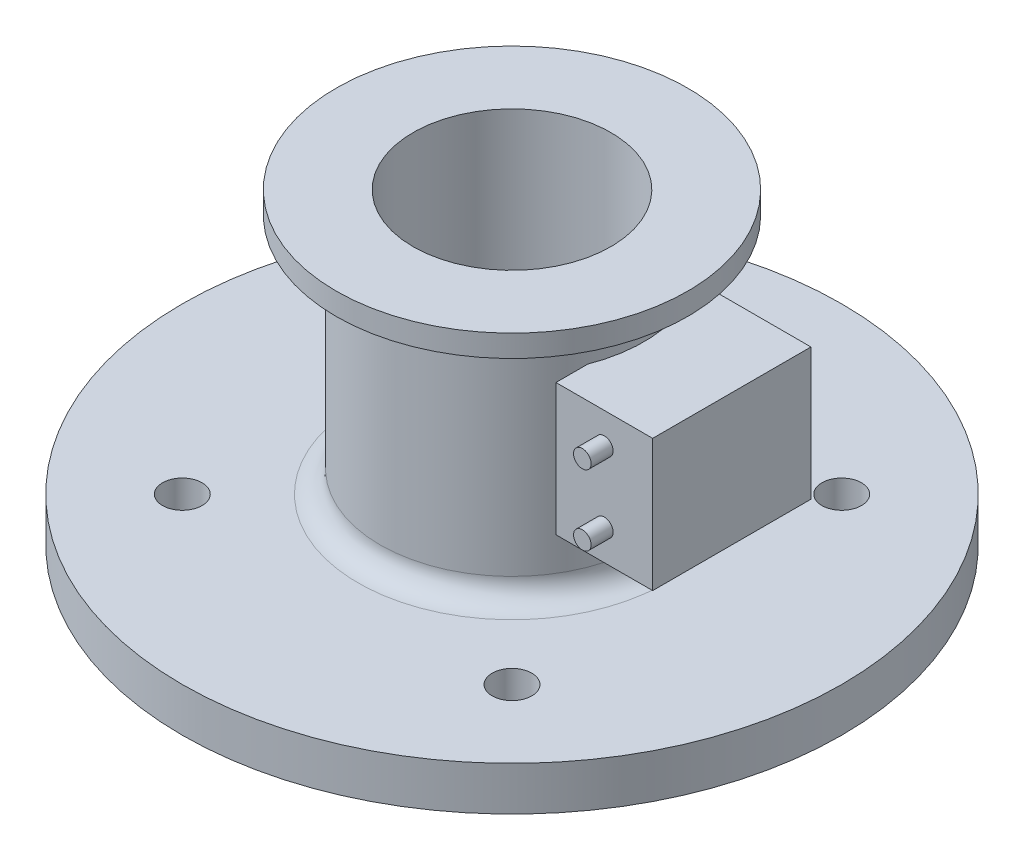
ISO-10303-21;
HEADER;
FILE_DESCRIPTION(('STEP AP214'),'2;1');
FILE_NAME('part.step','',(''),(''),'','','');
FILE_SCHEMA(('AUTOMOTIVE_DESIGN { 1 0 10303 214 1 1 1 1 }'));
ENDSEC;
DATA;
#1=APPLICATION_CONTEXT('core data for automotive mechanical design processes');
#2=APPLICATION_PROTOCOL_DEFINITION('international standard','automotive_design',2000,#1);
#3=PRODUCT_CONTEXT('',#1,'mechanical');
#4=PRODUCT('Part','Part','',(#3));
#5=PRODUCT_RELATED_PRODUCT_CATEGORY('part','',(#4));
#6=PRODUCT_DEFINITION_FORMATION('','',#4);
#7=PRODUCT_DEFINITION_CONTEXT('part definition',#1,'design');
#8=PRODUCT_DEFINITION('design','',#6,#7);
#9=PRODUCT_DEFINITION_SHAPE('','',#8);
#10=(LENGTH_UNIT() NAMED_UNIT(*) SI_UNIT(.MILLI.,.METRE.));
#11=(NAMED_UNIT(*) PLANE_ANGLE_UNIT() SI_UNIT($,.RADIAN.));
#12=(NAMED_UNIT(*) SI_UNIT($,.STERADIAN.) SOLID_ANGLE_UNIT());
#13=UNCERTAINTY_MEASURE_WITH_UNIT(LENGTH_MEASURE(1.E-05),#10,'distance_accuracy_value','');
#14=(GEOMETRIC_REPRESENTATION_CONTEXT(3) GLOBAL_UNCERTAINTY_ASSIGNED_CONTEXT((#13)) GLOBAL_UNIT_ASSIGNED_CONTEXT((#10,
#11,#12)) REPRESENTATION_CONTEXT('',''));
#15=CARTESIAN_POINT('',(0.,0.,0.));
#16=DIRECTION('',(0.,0.,1.));
#17=DIRECTION('',(1.,0.,0.));
#18=AXIS2_PLACEMENT_3D('',#15,#16,#17);
#19=CARTESIAN_POINT('',(50.,55.,18.));
#20=DIRECTION('',(-1.,0.,0.));
#21=DIRECTION('',(0.,0.,1.));
#22=AXIS2_PLACEMENT_3D('',#19,#20,#21);
#23=PLANE('',#22);
#24=DIRECTION('',(0.,0.,-1.));
#25=VECTOR('',#24,1.);
#26=CARTESIAN_POINT('',(50.,25.,18.));
#27=LINE('',#26,#25);
#28=CARTESIAN_POINT('',(50.,25.,18.));
#29=VERTEX_POINT('',#28);
#30=CARTESIAN_POINT('',(50.,25.,-18.));
#31=VERTEX_POINT('',#30);
#32=EDGE_CURVE('E111',#29,#31,#27,.T.);
#33=ORIENTED_EDGE('',*,*,#32,.T.);
#34=DIRECTION('',(0.,-1.,0.));
#35=VECTOR('',#34,1.);
#36=CARTESIAN_POINT('',(50.,55.,-18.));
#37=LINE('',#36,#35);
#38=CARTESIAN_POINT('',(50.,55.,-18.));
#39=VERTEX_POINT('',#38);
#40=EDGE_CURVE('E102',#39,#31,#37,.T.);
#41=ORIENTED_EDGE('',*,*,#40,.F.);
#42=DIRECTION('',(0.,0.,-1.));
#43=VECTOR('',#42,1.);
#44=CARTESIAN_POINT('',(50.,55.,18.));
#45=LINE('',#44,#43);
#46=CARTESIAN_POINT('',(50.,55.,18.));
#47=VERTEX_POINT('',#46);
#48=EDGE_CURVE('E96',#47,#39,#45,.T.);
#49=ORIENTED_EDGE('',*,*,#48,.F.);
#50=DIRECTION('',(0.,-1.,0.));
#51=VECTOR('',#50,1.);
#52=CARTESIAN_POINT('',(50.,55.,18.));
#53=LINE('',#52,#51);
#54=EDGE_CURVE('E107',#47,#29,#53,.T.);
#55=ORIENTED_EDGE('',*,*,#54,.T.);
#56=EDGE_LOOP('',(#33,#41,#49,#55));
#57=FACE_BOUND('',#56,.T.);
#58=ADVANCED_FACE('F44',(#57),#23,.F.);
#59=CARTESIAN_POINT('',(28.,55.,-18.));
#60=DIRECTION('',(0.,0.,1.));
#61=DIRECTION('',(1.,0.,0.));
#62=AXIS2_PLACEMENT_3D('',#59,#60,#61);
#63=PLANE('',#62);
#64=DIRECTION('',(-1.,0.,0.));
#65=VECTOR('',#64,1.);
#66=CARTESIAN_POINT('',(28.,25.,-18.));
#67=LINE('',#66,#65);
#68=CARTESIAN_POINT('',(28.,25.,-18.));
#69=VERTEX_POINT('',#68);
#70=EDGE_CURVE('E101',#31,#69,#67,.T.);
#71=ORIENTED_EDGE('',*,*,#70,.T.);
#72=DIRECTION('',(0.,-1.,0.));
#73=VECTOR('',#72,1.);
#74=CARTESIAN_POINT('',(28.,55.,-18.));
#75=LINE('',#74,#73);
#76=CARTESIAN_POINT('',(28.,55.,-18.));
#77=VERTEX_POINT('',#76);
#78=EDGE_CURVE('E99',#77,#69,#75,.T.);
#79=ORIENTED_EDGE('',*,*,#78,.F.);
#80=DIRECTION('',(-1.,0.,0.));
#81=VECTOR('',#80,1.);
#82=CARTESIAN_POINT('',(28.,55.,-18.));
#83=LINE('',#82,#81);
#84=EDGE_CURVE('E91',#39,#77,#83,.T.);
#85=ORIENTED_EDGE('',*,*,#84,.F.);
#86=ORIENTED_EDGE('',*,*,#40,.T.);
#87=EDGE_LOOP('',(#71,#79,#85,#86));
#88=FACE_BOUND('',#87,.T.);
#89=ADVANCED_FACE('F100',(#88),#63,.F.);
#90=CARTESIAN_POINT('',(28.,55.,18.));
#91=DIRECTION('',(1.,0.,0.));
#92=DIRECTION('',(0.,0.,-1.));
#93=AXIS2_PLACEMENT_3D('',#90,#91,#92);
#94=PLANE('',#93);
#95=DIRECTION('',(0.,0.,1.));
#96=VECTOR('',#95,1.);
#97=CARTESIAN_POINT('',(28.,25.,18.));
#98=LINE('',#97,#96);
#99=CARTESIAN_POINT('',(28.,25.,18.));
#100=VERTEX_POINT('',#99);
#101=EDGE_CURVE('E77',#69,#100,#98,.T.);
#102=ORIENTED_EDGE('',*,*,#101,.T.);
#103=DIRECTION('',(0.,-1.,0.));
#104=VECTOR('',#103,1.);
#105=CARTESIAN_POINT('',(28.,55.,18.));
#106=LINE('',#105,#104);
#107=CARTESIAN_POINT('',(28.,55.,18.));
#108=VERTEX_POINT('',#107);
#109=EDGE_CURVE('E103',#108,#100,#106,.T.);
#110=ORIENTED_EDGE('',*,*,#109,.F.);
#111=DIRECTION('',(0.,0.,1.));
#112=VECTOR('',#111,1.);
#113=CARTESIAN_POINT('',(28.,55.,18.));
#114=LINE('',#113,#112);
#115=EDGE_CURVE('E94',#77,#108,#114,.T.);
#116=ORIENTED_EDGE('',*,*,#115,.F.);
#117=ORIENTED_EDGE('',*,*,#78,.T.);
#118=EDGE_LOOP('',(#102,#110,#116,#117));
#119=FACE_BOUND('',#118,.T.);
#120=ADVANCED_FACE('F105',(#119),#94,.F.);
#121=CARTESIAN_POINT('',(28.,55.,18.));
#122=DIRECTION('',(0.,0.,-1.));
#123=DIRECTION('',(-1.,0.,0.));
#124=AXIS2_PLACEMENT_3D('',#121,#122,#123);
#125=PLANE('',#124);
#126=CARTESIAN_POINT('',(39.,32.,18.));
#127=DIRECTION('',(0.,0.,-1.));
#128=DIRECTION('',(-1.,0.,0.));
#129=AXIS2_PLACEMENT_3D('',#126,#127,#128);
#130=CIRCLE('',#129,2.);
#131=CARTESIAN_POINT('',(37.,32.,18.));
#132=VERTEX_POINT('',#131);
#133=EDGE_CURVE('E12',#132,#132,#130,.F.);
#134=ORIENTED_EDGE('',*,*,#133,.F.);
#135=EDGE_LOOP('',(#134));
#136=FACE_BOUND('',#135,.T.);
#137=CARTESIAN_POINT('',(39.,48.,18.));
#138=DIRECTION('',(0.,0.,-1.));
#139=DIRECTION('',(-1.,0.,0.));
#140=AXIS2_PLACEMENT_3D('',#137,#138,#139);
#141=CIRCLE('',#140,2.);
#142=CARTESIAN_POINT('',(37.,48.,18.));
#143=VERTEX_POINT('',#142);
#144=EDGE_CURVE('E52',#143,#143,#141,.F.);
#145=ORIENTED_EDGE('',*,*,#144,.F.);
#146=EDGE_LOOP('',(#145));
#147=FACE_BOUND('',#146,.T.);
#148=DIRECTION('',(1.,0.,0.));
#149=VECTOR('',#148,1.);
#150=CARTESIAN_POINT('',(28.,25.,18.));
#151=LINE('',#150,#149);
#152=EDGE_CURVE('E83',#100,#29,#151,.T.);
#153=ORIENTED_EDGE('',*,*,#152,.T.);
#154=ORIENTED_EDGE('',*,*,#54,.F.);
#155=DIRECTION('',(1.,0.,0.));
#156=VECTOR('',#155,1.);
#157=CARTESIAN_POINT('',(28.,55.,18.));
#158=LINE('',#157,#156);
#159=EDGE_CURVE('E60',#108,#47,#158,.T.);
#160=ORIENTED_EDGE('',*,*,#159,.F.);
#161=ORIENTED_EDGE('',*,*,#109,.T.);
#162=EDGE_LOOP('',(#153,#154,#160,#161));
#163=FACE_BOUND('',#162,.T.);
#164=ADVANCED_FACE('F125',(#136,#147,#163),#125,.F.);
#165=CARTESIAN_POINT('',(0.,55.,0.));
#166=DIRECTION('',(0.,-1.,0.));
#167=DIRECTION('',(0.,0.,-1.));
#168=AXIS2_PLACEMENT_3D('',#165,#166,#167);
#169=PLANE('',#168);
#170=ORIENTED_EDGE('',*,*,#48,.T.);
#171=ORIENTED_EDGE('',*,*,#84,.T.);
#172=ORIENTED_EDGE('',*,*,#115,.T.);
#173=ORIENTED_EDGE('',*,*,#159,.T.);
#174=EDGE_LOOP('',(#170,#171,#172,#173));
#175=FACE_BOUND('',#174,.T.);
#176=ADVANCED_FACE('F92',(#175),#169,.F.);
#177=CARTESIAN_POINT('',(0.,25.,0.));
#178=DIRECTION('',(0.,-1.,0.));
#179=DIRECTION('',(0.,0.,-1.));
#180=AXIS2_PLACEMENT_3D('',#177,#178,#179);
#181=PLANE('',#180);
#182=ORIENTED_EDGE('',*,*,#32,.F.);
#183=ORIENTED_EDGE('',*,*,#152,.F.);
#184=ORIENTED_EDGE('',*,*,#101,.F.);
#185=ORIENTED_EDGE('',*,*,#70,.F.);
#186=EDGE_LOOP('',(#182,#183,#184,#185));
#187=FACE_BOUND('',#186,.T.);
#188=ADVANCED_FACE('F133',(#187),#181,.T.);
#189=CARTESIAN_POINT('',(39.,48.,23.));
#190=DIRECTION('',(0.,0.,-1.));
#191=DIRECTION('',(-1.,0.,0.));
#192=AXIS2_PLACEMENT_3D('',#189,#190,#191);
#193=CYLINDRICAL_SURFACE('',#192,2.);
#194=CARTESIAN_POINT('',(39.,48.,23.));
#195=DIRECTION('',(0.,0.,1.));
#196=DIRECTION('',(1.,0.,0.));
#197=AXIS2_PLACEMENT_3D('',#194,#195,#196);
#198=CIRCLE('',#197,2.);
#199=CARTESIAN_POINT('',(41.,48.,23.));
#200=VERTEX_POINT('',#199);
#201=EDGE_CURVE('E114',#200,#200,#198,.T.);
#202=ORIENTED_EDGE('',*,*,#201,.F.);
#203=EDGE_LOOP('',(#202));
#204=FACE_BOUND('',#203,.T.);
#205=ORIENTED_EDGE('',*,*,#144,.T.);
#206=EDGE_LOOP('',(#205));
#207=FACE_BOUND('',#206,.T.);
#208=ADVANCED_FACE('F123',(#204,#207),#193,.T.);
#209=CARTESIAN_POINT('',(39.,48.,23.));
#210=DIRECTION('',(0.,0.,1.));
#211=DIRECTION('',(1.,0.,0.));
#212=AXIS2_PLACEMENT_3D('',#209,#210,#211);
#213=PLANE('',#212);
#214=ORIENTED_EDGE('',*,*,#201,.T.);
#215=EDGE_LOOP('',(#214));
#216=FACE_BOUND('',#215,.T.);
#217=ADVANCED_FACE('F149',(#216),#213,.T.);
#218=CARTESIAN_POINT('',(39.,32.,23.));
#219=DIRECTION('',(0.,0.,-1.));
#220=DIRECTION('',(-1.,0.,0.));
#221=AXIS2_PLACEMENT_3D('',#218,#219,#220);
#222=CYLINDRICAL_SURFACE('',#221,2.);
#223=CARTESIAN_POINT('',(39.,32.,23.));
#224=DIRECTION('',(0.,0.,1.));
#225=DIRECTION('',(1.,0.,0.));
#226=AXIS2_PLACEMENT_3D('',#223,#224,#225);
#227=CIRCLE('',#226,2.);
#228=CARTESIAN_POINT('',(41.,32.,23.));
#229=VERTEX_POINT('',#228);
#230=EDGE_CURVE('E167',#229,#229,#227,.T.);
#231=ORIENTED_EDGE('',*,*,#230,.F.);
#232=EDGE_LOOP('',(#231));
#233=FACE_BOUND('',#232,.T.);
#234=ORIENTED_EDGE('',*,*,#133,.T.);
#235=EDGE_LOOP('',(#234));
#236=FACE_BOUND('',#235,.T.);
#237=ADVANCED_FACE('F155',(#233,#236),#222,.T.);
#238=CARTESIAN_POINT('',(39.,32.,23.));
#239=DIRECTION('',(0.,0.,1.));
#240=DIRECTION('',(1.,0.,0.));
#241=AXIS2_PLACEMENT_3D('',#238,#239,#240);
#242=PLANE('',#241);
#243=ORIENTED_EDGE('',*,*,#230,.T.);
#244=EDGE_LOOP('',(#243));
#245=FACE_BOUND('',#244,.T.);
#246=ADVANCED_FACE('F159',(#245),#242,.T.);
#247=CLOSED_SHELL('',(#58,#89,#120,#164,#176,#188,#208,#217,#237,#246));
#248=MANIFOLD_SOLID_BREP('B2',#247);
#249=CARTESIAN_POINT('',(0.,70.,0.));
#250=DIRECTION('',(0.,-1.,0.));
#251=DIRECTION('',(0.,0.,-1.));
#252=AXIS2_PLACEMENT_3D('',#249,#250,#251);
#253=CYLINDRICAL_SURFACE('',#252,30.);
#254=CARTESIAN_POINT('',(0.,60.,0.));
#255=DIRECTION('',(0.,1.,0.));
#256=DIRECTION('',(0.,0.,1.));
#257=AXIS2_PLACEMENT_3D('',#254,#255,#256);
#258=CIRCLE('',#257,30.);
#259=CARTESIAN_POINT('',(0.,60.,30.));
#260=VERTEX_POINT('',#259);
#261=EDGE_CURVE('E234',#260,#260,#258,.F.);
#262=ORIENTED_EDGE('',*,*,#261,.T.);
#263=EDGE_LOOP('',(#262));
#264=FACE_BOUND('',#263,.T.);
#265=CARTESIAN_POINT('',(0.,15.,0.));
#266=DIRECTION('',(0.,-1.,0.));
#267=DIRECTION('',(0.,0.,-1.));
#268=AXIS2_PLACEMENT_3D('',#265,#266,#267);
#269=CIRCLE('',#268,30.);
#270=CARTESIAN_POINT('',(0.,15.,-30.));
#271=VERTEX_POINT('',#270);
#272=EDGE_CURVE('E238',#271,#271,#269,.F.);
#273=ORIENTED_EDGE('',*,*,#272,.T.);
#274=EDGE_LOOP('',(#273));
#275=FACE_BOUND('',#274,.T.);
#276=ADVANCED_FACE('F227',(#264,#275),#253,.T.);
#277=CARTESIAN_POINT('',(0.,10.,0.));
#278=DIRECTION('',(0.,-1.,0.));
#279=DIRECTION('',(0.,0.,-1.));
#280=AXIS2_PLACEMENT_3D('',#277,#278,#279);
#281=PLANE('',#280);
#282=CARTESIAN_POINT('',(0.,10.,0.));
#283=DIRECTION('',(0.,-1.,0.));
#284=DIRECTION('',(0.,0.,-1.));
#285=AXIS2_PLACEMENT_3D('',#282,#283,#284);
#286=CIRCLE('',#285,35.);
#287=CARTESIAN_POINT('',(0.,10.,-35.));
#288=VERTEX_POINT('',#287);
#289=EDGE_CURVE('E43',#288,#288,#286,.T.);
#290=ORIENTED_EDGE('',*,*,#289,.T.);
#291=EDGE_LOOP('',(#290));
#292=FACE_BOUND('',#291,.T.);
#293=CARTESIAN_POINT('',(-37.5,10.,-37.5));
#294=DIRECTION('',(0.,1.,0.));
#295=DIRECTION('',(0.,0.,1.));
#296=AXIS2_PLACEMENT_3D('',#293,#294,#295);
#297=CIRCLE('',#296,4.50000000000001);
#298=CARTESIAN_POINT('',(-37.5,10.,-33.));
#299=VERTEX_POINT('',#298);
#300=EDGE_CURVE('E247',#299,#299,#297,.T.);
#301=ORIENTED_EDGE('',*,*,#300,.F.);
#302=EDGE_LOOP('',(#301));
#303=FACE_BOUND('',#302,.T.);
#304=CARTESIAN_POINT('',(37.5,10.,-37.5));
#305=DIRECTION('',(0.,1.,0.));
#306=DIRECTION('',(0.,0.,1.));
#307=AXIS2_PLACEMENT_3D('',#304,#305,#306);
#308=CIRCLE('',#307,4.5);
#309=CARTESIAN_POINT('',(37.5,10.,-33.));
#310=VERTEX_POINT('',#309);
#311=EDGE_CURVE('E251',#310,#310,#308,.T.);
#312=ORIENTED_EDGE('',*,*,#311,.F.);
#313=EDGE_LOOP('',(#312));
#314=FACE_BOUND('',#313,.T.);
#315=CARTESIAN_POINT('',(37.5,10.,37.5));
#316=DIRECTION('',(0.,1.,0.));
#317=DIRECTION('',(0.,0.,1.));
#318=AXIS2_PLACEMENT_3D('',#315,#316,#317);
#319=CIRCLE('',#318,4.5);
#320=CARTESIAN_POINT('',(37.5,10.,42.));
#321=VERTEX_POINT('',#320);
#322=EDGE_CURVE('E257',#321,#321,#319,.T.);
#323=ORIENTED_EDGE('',*,*,#322,.F.);
#324=EDGE_LOOP('',(#323));
#325=FACE_BOUND('',#324,.T.);
#326=CARTESIAN_POINT('',(-37.5,10.,37.5));
#327=DIRECTION('',(0.,1.,0.));
#328=DIRECTION('',(0.,0.,1.));
#329=AXIS2_PLACEMENT_3D('',#326,#327,#328);
#330=CIRCLE('',#329,4.50000000000001);
#331=CARTESIAN_POINT('',(-37.5,10.,42.));
#332=VERTEX_POINT('',#331);
#333=EDGE_CURVE('E263',#332,#332,#330,.T.);
#334=ORIENTED_EDGE('',*,*,#333,.F.);
#335=EDGE_LOOP('',(#334));
#336=FACE_BOUND('',#335,.T.);
#337=CARTESIAN_POINT('',(0.,10.,0.));
#338=DIRECTION('',(0.,1.,0.));
#339=DIRECTION('',(0.,0.,1.));
#340=AXIS2_PLACEMENT_3D('',#337,#338,#339);
#341=CIRCLE('',#340,75.);
#342=CARTESIAN_POINT('',(0.,10.,75.));
#343=VERTEX_POINT('',#342);
#344=EDGE_CURVE('E281',#343,#343,#341,.T.);
#345=ORIENTED_EDGE('',*,*,#344,.T.);
#346=EDGE_LOOP('',(#345));
#347=FACE_BOUND('',#346,.T.);
#348=ADVANCED_FACE('F290',(#292,#303,#314,#325,#336,#347),#281,.F.);
#349=CARTESIAN_POINT('',(0.,0.,0.));
#350=DIRECTION('',(0.,-1.,0.));
#351=DIRECTION('',(0.,0.,-1.));
#352=AXIS2_PLACEMENT_3D('',#349,#350,#351);
#353=PLANE('',#352);
#354=CARTESIAN_POINT('',(37.5,0.,37.5));
#355=DIRECTION('',(0.,1.,0.));
#356=DIRECTION('',(0.,0.,1.));
#357=AXIS2_PLACEMENT_3D('',#354,#355,#356);
#358=CIRCLE('',#357,4.5);
#359=CARTESIAN_POINT('',(37.5,0.,42.));
#360=VERTEX_POINT('',#359);
#361=EDGE_CURVE('E260',#360,#360,#358,.T.);
#362=ORIENTED_EDGE('',*,*,#361,.T.);
#363=EDGE_LOOP('',(#362));
#364=FACE_BOUND('',#363,.T.);
#365=CARTESIAN_POINT('',(-37.5,0.,-37.5));
#366=DIRECTION('',(0.,1.,0.));
#367=DIRECTION('',(0.,0.,1.));
#368=AXIS2_PLACEMENT_3D('',#365,#366,#367);
#369=CIRCLE('',#368,4.50000000000001);
#370=CARTESIAN_POINT('',(-37.5,0.,-33.));
#371=VERTEX_POINT('',#370);
#372=EDGE_CURVE('E248',#371,#371,#369,.T.);
#373=ORIENTED_EDGE('',*,*,#372,.T.);
#374=EDGE_LOOP('',(#373));
#375=FACE_BOUND('',#374,.T.);
#376=CARTESIAN_POINT('',(37.5,0.,-37.5));
#377=DIRECTION('',(0.,1.,0.));
#378=DIRECTION('',(0.,0.,1.));
#379=AXIS2_PLACEMENT_3D('',#376,#377,#378);
#380=CIRCLE('',#379,4.5);
#381=CARTESIAN_POINT('',(37.5,0.,-33.));
#382=VERTEX_POINT('',#381);
#383=EDGE_CURVE('E254',#382,#382,#380,.T.);
#384=ORIENTED_EDGE('',*,*,#383,.T.);
#385=EDGE_LOOP('',(#384));
#386=FACE_BOUND('',#385,.T.);
#387=CARTESIAN_POINT('',(-37.5,0.,37.5));
#388=DIRECTION('',(0.,1.,0.));
#389=DIRECTION('',(0.,0.,1.));
#390=AXIS2_PLACEMENT_3D('',#387,#388,#389);
#391=CIRCLE('',#390,4.50000000000001);
#392=CARTESIAN_POINT('',(-37.5,0.,42.));
#393=VERTEX_POINT('',#392);
#394=EDGE_CURVE('E266',#393,#393,#391,.T.);
#395=ORIENTED_EDGE('',*,*,#394,.T.);
#396=EDGE_LOOP('',(#395));
#397=FACE_BOUND('',#396,.T.);
#398=CARTESIAN_POINT('',(0.,0.,0.));
#399=DIRECTION('',(0.,1.,0.));
#400=DIRECTION('',(0.,0.,1.));
#401=AXIS2_PLACEMENT_3D('',#398,#399,#400);
#402=CIRCLE('',#401,75.);
#403=CARTESIAN_POINT('',(0.,0.,75.));
#404=VERTEX_POINT('',#403);
#405=EDGE_CURVE('E284',#404,#404,#402,.T.);
#406=ORIENTED_EDGE('',*,*,#405,.F.);
#407=EDGE_LOOP('',(#406));
#408=FACE_BOUND('',#407,.T.);
#409=ADVANCED_FACE('F298',(#364,#375,#386,#397,#408),#353,.T.);
#410=CARTESIAN_POINT('',(-37.5,10.,-37.5));
#411=DIRECTION('',(0.,-1.,0.));
#412=DIRECTION('',(0.,0.,-1.));
#413=AXIS2_PLACEMENT_3D('',#410,#411,#412);
#414=CYLINDRICAL_SURFACE('',#413,4.50000000000001);
#415=ORIENTED_EDGE('',*,*,#300,.T.);
#416=EDGE_LOOP('',(#415));
#417=FACE_BOUND('',#416,.T.);
#418=ORIENTED_EDGE('',*,*,#372,.F.);
#419=EDGE_LOOP('',(#418));
#420=FACE_BOUND('',#419,.T.);
#421=ADVANCED_FACE('F300',(#417,#420),#414,.F.);
#422=CARTESIAN_POINT('',(37.5,10.,-37.5));
#423=DIRECTION('',(0.,-1.,0.));
#424=DIRECTION('',(0.,0.,-1.));
#425=AXIS2_PLACEMENT_3D('',#422,#423,#424);
#426=CYLINDRICAL_SURFACE('',#425,4.5);
#427=ORIENTED_EDGE('',*,*,#311,.T.);
#428=EDGE_LOOP('',(#427));
#429=FACE_BOUND('',#428,.T.);
#430=ORIENTED_EDGE('',*,*,#383,.F.);
#431=EDGE_LOOP('',(#430));
#432=FACE_BOUND('',#431,.T.);
#433=ADVANCED_FACE('F307',(#429,#432),#426,.F.);
#434=CARTESIAN_POINT('',(37.5,10.,37.5));
#435=DIRECTION('',(0.,-1.,0.));
#436=DIRECTION('',(0.,0.,-1.));
#437=AXIS2_PLACEMENT_3D('',#434,#435,#436);
#438=CYLINDRICAL_SURFACE('',#437,4.5);
#439=ORIENTED_EDGE('',*,*,#322,.T.);
#440=EDGE_LOOP('',(#439));
#441=FACE_BOUND('',#440,.T.);
#442=ORIENTED_EDGE('',*,*,#361,.F.);
#443=EDGE_LOOP('',(#442));
#444=FACE_BOUND('',#443,.T.);
#445=ADVANCED_FACE('F326',(#441,#444),#438,.F.);
#446=CARTESIAN_POINT('',(-37.5,10.,37.5));
#447=DIRECTION('',(0.,-1.,0.));
#448=DIRECTION('',(0.,0.,-1.));
#449=AXIS2_PLACEMENT_3D('',#446,#447,#448);
#450=CYLINDRICAL_SURFACE('',#449,4.50000000000001);
#451=ORIENTED_EDGE('',*,*,#333,.T.);
#452=EDGE_LOOP('',(#451));
#453=FACE_BOUND('',#452,.T.);
#454=ORIENTED_EDGE('',*,*,#394,.F.);
#455=EDGE_LOOP('',(#454));
#456=FACE_BOUND('',#455,.T.);
#457=ADVANCED_FACE('F322',(#453,#456),#450,.F.);
#458=CARTESIAN_POINT('',(0.,65.,0.));
#459=DIRECTION('',(0.,1.,0.));
#460=DIRECTION('',(0.,0.,1.));
#461=AXIS2_PLACEMENT_3D('',#458,#459,#460);
#462=CYLINDRICAL_SURFACE('',#461,40.);
#463=CARTESIAN_POINT('',(0.,65.,0.));
#464=DIRECTION('',(0.,1.,0.));
#465=DIRECTION('',(0.,0.,1.));
#466=AXIS2_PLACEMENT_3D('',#463,#464,#465);
#467=CIRCLE('',#466,40.);
#468=CARTESIAN_POINT('',(0.,65.,40.));
#469=VERTEX_POINT('',#468);
#470=EDGE_CURVE('E275',#469,#469,#467,.T.);
#471=ORIENTED_EDGE('',*,*,#470,.T.);
#472=EDGE_LOOP('',(#471));
#473=FACE_BOUND('',#472,.T.);
#474=CARTESIAN_POINT('',(0.,70.,0.));
#475=DIRECTION('',(0.,1.,0.));
#476=DIRECTION('',(0.,0.,1.));
#477=AXIS2_PLACEMENT_3D('',#474,#475,#476);
#478=CIRCLE('',#477,40.);
#479=CARTESIAN_POINT('',(0.,70.,40.));
#480=VERTEX_POINT('',#479);
#481=EDGE_CURVE('E278',#480,#480,#478,.T.);
#482=ORIENTED_EDGE('',*,*,#481,.F.);
#483=EDGE_LOOP('',(#482));
#484=FACE_BOUND('',#483,.T.);
#485=ADVANCED_FACE('F325',(#473,#484),#462,.T.);
#486=CARTESIAN_POINT('',(0.,65.,0.));
#487=DIRECTION('',(0.,1.,0.));
#488=DIRECTION('',(0.,0.,1.));
#489=AXIS2_PLACEMENT_3D('',#486,#487,#488);
#490=PLANE('',#489);
#491=CARTESIAN_POINT('',(0.,65.,0.));
#492=DIRECTION('',(0.,1.,0.));
#493=DIRECTION('',(0.,0.,1.));
#494=AXIS2_PLACEMENT_3D('',#491,#492,#493);
#495=CIRCLE('',#494,35.);
#496=CARTESIAN_POINT('',(0.,65.,35.));
#497=VERTEX_POINT('',#496);
#498=EDGE_CURVE('E242',#497,#497,#495,.T.);
#499=ORIENTED_EDGE('',*,*,#498,.T.);
#500=EDGE_LOOP('',(#499));
#501=FACE_BOUND('',#500,.T.);
#502=ORIENTED_EDGE('',*,*,#470,.F.);
#503=EDGE_LOOP('',(#502));
#504=FACE_BOUND('',#503,.T.);
#505=ADVANCED_FACE('F366',(#501,#504),#490,.F.);
#506=CARTESIAN_POINT('',(0.,10.,0.));
#507=DIRECTION('',(0.,1.,0.));
#508=DIRECTION('',(0.,0.,1.));
#509=AXIS2_PLACEMENT_3D('',#506,#507,#508);
#510=CIRCLE('',#509,22.5);
#511=CARTESIAN_POINT('',(0.,10.,22.5));
#512=VERTEX_POINT('',#511);
#513=EDGE_CURVE('E272',#512,#512,#510,.T.);
#514=ORIENTED_EDGE('',*,*,#513,.T.);
#515=EDGE_LOOP('',(#514));
#516=FACE_BOUND('',#515,.T.);
#517=ADVANCED_FACE('F311',(#516),#281,.F.);
#518=CARTESIAN_POINT('',(0.,70.,0.));
#519=DIRECTION('',(0.,-1.,0.));
#520=DIRECTION('',(0.,0.,-1.));
#521=AXIS2_PLACEMENT_3D('',#518,#519,#520);
#522=CYLINDRICAL_SURFACE('',#521,22.5);
#523=CARTESIAN_POINT('',(0.,70.,0.));
#524=DIRECTION('',(0.,1.,0.));
#525=DIRECTION('',(0.,0.,1.));
#526=AXIS2_PLACEMENT_3D('',#523,#524,#525);
#527=CIRCLE('',#526,22.5);
#528=CARTESIAN_POINT('',(0.,70.,22.5));
#529=VERTEX_POINT('',#528);
#530=EDGE_CURVE('E269',#529,#529,#527,.T.);
#531=ORIENTED_EDGE('',*,*,#530,.T.);
#532=EDGE_LOOP('',(#531));
#533=FACE_BOUND('',#532,.T.);
#534=ORIENTED_EDGE('',*,*,#513,.F.);
#535=EDGE_LOOP('',(#534));
#536=FACE_BOUND('',#535,.T.);
#537=ADVANCED_FACE('F383',(#533,#536),#522,.F.);
#538=CARTESIAN_POINT('',(0.,70.,0.));
#539=DIRECTION('',(0.,1.,0.));
#540=DIRECTION('',(0.,0.,1.));
#541=AXIS2_PLACEMENT_3D('',#538,#539,#540);
#542=PLANE('',#541);
#543=ORIENTED_EDGE('',*,*,#530,.F.);
#544=EDGE_LOOP('',(#543));
#545=FACE_BOUND('',#544,.T.);
#546=ORIENTED_EDGE('',*,*,#481,.T.);
#547=EDGE_LOOP('',(#546));
#548=FACE_BOUND('',#547,.T.);
#549=ADVANCED_FACE('F320',(#545,#548),#542,.T.);
#550=CARTESIAN_POINT('',(0.,60.,0.));
#551=DIRECTION('',(0.,1.,0.));
#552=DIRECTION('',(0.,0.,1.));
#553=AXIS2_PLACEMENT_3D('',#550,#551,#552);
#554=TOROIDAL_SURFACE('',#553,35.,5.);
#555=ORIENTED_EDGE('',*,*,#261,.F.);
#556=EDGE_LOOP('',(#555));
#557=FACE_BOUND('',#556,.T.);
#558=ORIENTED_EDGE('',*,*,#498,.F.);
#559=EDGE_LOOP('',(#558));
#560=FACE_BOUND('',#559,.T.);
#561=ADVANCED_FACE('F394',(#557,#560),#554,.F.);
#562=CARTESIAN_POINT('',(0.,15.,0.));
#563=DIRECTION('',(0.,-1.,0.));
#564=DIRECTION('',(0.,0.,-1.));
#565=AXIS2_PLACEMENT_3D('',#562,#563,#564);
#566=TOROIDAL_SURFACE('',#565,35.,5.);
#567=ORIENTED_EDGE('',*,*,#289,.F.);
#568=EDGE_LOOP('',(#567));
#569=FACE_BOUND('',#568,.T.);
#570=ORIENTED_EDGE('',*,*,#272,.F.);
#571=EDGE_LOOP('',(#570));
#572=FACE_BOUND('',#571,.T.);
#573=ADVANCED_FACE('F229',(#569,#572),#566,.F.);
#574=CARTESIAN_POINT('',(0.,10.,0.));
#575=DIRECTION('',(0.,-1.,0.));
#576=DIRECTION('',(0.,0.,-1.));
#577=AXIS2_PLACEMENT_3D('',#574,#575,#576);
#578=CYLINDRICAL_SURFACE('',#577,75.);
#579=ORIENTED_EDGE('',*,*,#344,.F.);
#580=EDGE_LOOP('',(#579));
#581=FACE_BOUND('',#580,.T.);
#582=ORIENTED_EDGE('',*,*,#405,.T.);
#583=EDGE_LOOP('',(#582));
#584=FACE_BOUND('',#583,.T.);
#585=ADVANCED_FACE('F292',(#581,#584),#578,.T.);
#586=CLOSED_SHELL('',(#276,#348,#409,#421,#433,#445,#457,#485,#505,#517,#537,#549,#561,#573,#585));
#587=MANIFOLD_SOLID_BREP('B6',#586);
#588=ADVANCED_BREP_SHAPE_REPRESENTATION('',(#18,#248,#587),#14);
#589=SHAPE_DEFINITION_REPRESENTATION(#9,#588);
ENDSEC;
END-ISO-10303-21;
